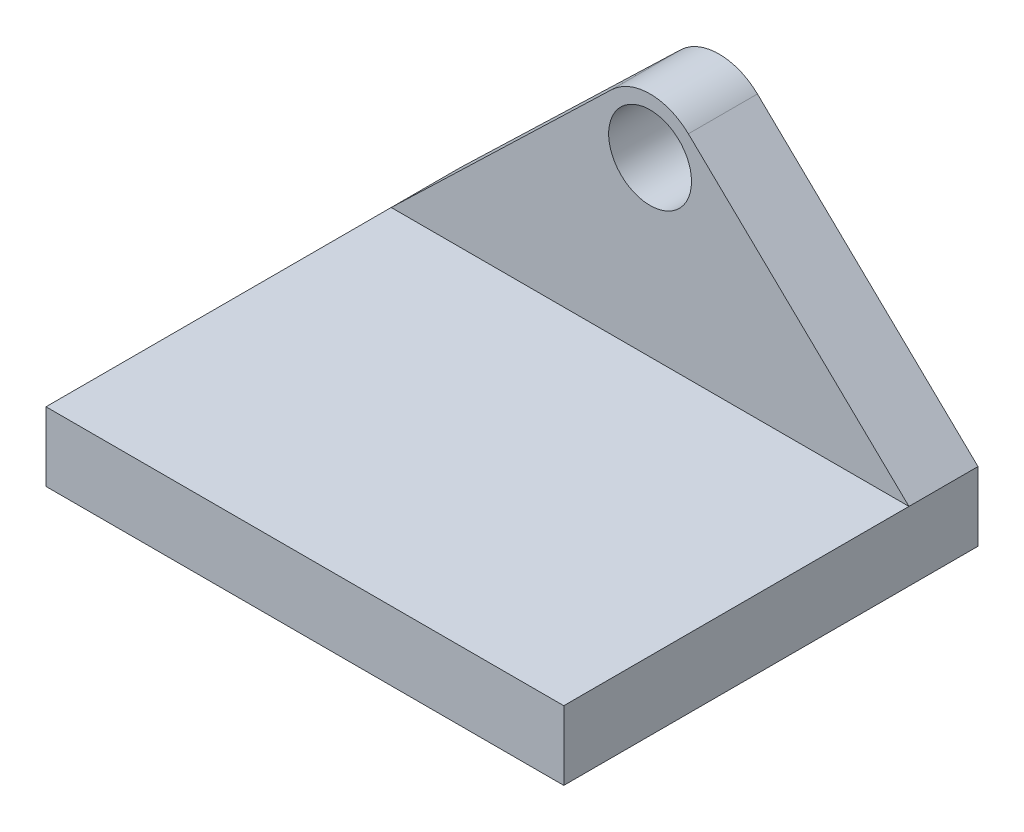
ISO-10303-21;
HEADER;
FILE_DESCRIPTION(('STEP AP214'),'2;1');
FILE_NAME('part.step','',(''),(''),'','','');
FILE_SCHEMA(('AUTOMOTIVE_DESIGN { 1 0 10303 214 1 1 1 1 }'));
ENDSEC;
DATA;
#1=APPLICATION_CONTEXT('core data for automotive mechanical design processes');
#2=APPLICATION_PROTOCOL_DEFINITION('international standard','automotive_design',2000,#1);
#3=PRODUCT_CONTEXT('',#1,'mechanical');
#4=PRODUCT('Part','Part','',(#3));
#5=PRODUCT_RELATED_PRODUCT_CATEGORY('part','',(#4));
#6=PRODUCT_DEFINITION_FORMATION('','',#4);
#7=PRODUCT_DEFINITION_CONTEXT('part definition',#1,'design');
#8=PRODUCT_DEFINITION('design','',#6,#7);
#9=PRODUCT_DEFINITION_SHAPE('','',#8);
#10=(LENGTH_UNIT() NAMED_UNIT(*) SI_UNIT(.MILLI.,.METRE.));
#11=(NAMED_UNIT(*) PLANE_ANGLE_UNIT() SI_UNIT($,.RADIAN.));
#12=(NAMED_UNIT(*) SI_UNIT($,.STERADIAN.) SOLID_ANGLE_UNIT());
#13=UNCERTAINTY_MEASURE_WITH_UNIT(LENGTH_MEASURE(1.E-05),#10,'distance_accuracy_value','');
#14=(GEOMETRIC_REPRESENTATION_CONTEXT(3) GLOBAL_UNCERTAINTY_ASSIGNED_CONTEXT((#13)) GLOBAL_UNIT_ASSIGNED_CONTEXT((#10,
#11,#12)) REPRESENTATION_CONTEXT('',''));
#15=CARTESIAN_POINT('',(0.,0.,0.));
#16=DIRECTION('',(0.,0.,1.));
#17=DIRECTION('',(1.,0.,0.));
#18=AXIS2_PLACEMENT_3D('',#15,#16,#17);
#19=CARTESIAN_POINT('',(0.,30.,0.));
#20=DIRECTION('',(0.,0.,1.));
#21=DIRECTION('',(1.,0.,0.));
#22=AXIS2_PLACEMENT_3D('',#19,#20,#21);
#23=PLANE('',#22);
#24=CARTESIAN_POINT('',(0.,30.,0.));
#25=DIRECTION('',(0.,0.,1.));
#26=DIRECTION('',(1.,0.,0.));
#27=AXIS2_PLACEMENT_3D('',#24,#25,#26);
#28=CIRCLE('',#27,6.);
#29=CARTESIAN_POINT('',(6.,30.,0.));
#30=VERTEX_POINT('',#29);
#31=EDGE_CURVE('E251',#30,#30,#28,.T.);
#32=ORIENTED_EDGE('',*,*,#31,.T.);
#33=EDGE_LOOP('',(#32));
#34=FACE_BOUND('',#33,.T.);
#35=DIRECTION('',(0.,-1.,0.));
#36=VECTOR('',#35,1.);
#37=CARTESIAN_POINT('',(-37.5,-5.,0.));
#38=LINE('',#37,#36);
#39=CARTESIAN_POINT('',(-37.5,5.,0.));
#40=VERTEX_POINT('',#39);
#41=CARTESIAN_POINT('',(-37.5,-5.,0.));
#42=VERTEX_POINT('',#41);
#43=EDGE_CURVE('E273',#40,#42,#38,.T.);
#44=ORIENTED_EDGE('',*,*,#43,.F.);
#45=DIRECTION('',(-0.720375853549973,-0.693583902366648,0.));
#46=VECTOR('',#45,1.);
#47=CARTESIAN_POINT('',(-37.5,5.,0.));
#48=LINE('',#47,#46);
#49=CARTESIAN_POINT('',(-5.54867121893319,35.7630068283998,0.));
#50=VERTEX_POINT('',#49);
#51=EDGE_CURVE('E271',#50,#40,#48,.T.);
#52=ORIENTED_EDGE('',*,*,#51,.F.);
#53=CARTESIAN_POINT('',(0.,30.,0.));
#54=DIRECTION('',(0.,0.,1.));
#55=DIRECTION('',(1.,0.,0.));
#56=AXIS2_PLACEMENT_3D('',#53,#54,#55);
#57=CIRCLE('',#56,8.);
#58=CARTESIAN_POINT('',(5.54867121893319,35.7630068283998,0.));
#59=VERTEX_POINT('',#58);
#60=EDGE_CURVE('E269',#59,#50,#57,.T.);
#61=ORIENTED_EDGE('',*,*,#60,.F.);
#62=DIRECTION('',(-0.720375853549972,0.693583902366649,0.));
#63=VECTOR('',#62,1.);
#64=CARTESIAN_POINT('',(37.5,5.,0.));
#65=LINE('',#64,#63);
#66=CARTESIAN_POINT('',(37.5,5.,0.));
#67=VERTEX_POINT('',#66);
#68=EDGE_CURVE('E255',#67,#59,#65,.T.);
#69=ORIENTED_EDGE('',*,*,#68,.F.);
#70=DIRECTION('',(0.,1.,0.));
#71=VECTOR('',#70,1.);
#72=CARTESIAN_POINT('',(37.5,-5.,0.));
#73=LINE('',#72,#71);
#74=CARTESIAN_POINT('',(37.5,-5.,0.));
#75=VERTEX_POINT('',#74);
#76=EDGE_CURVE('E262',#75,#67,#73,.T.);
#77=ORIENTED_EDGE('',*,*,#76,.F.);
#78=DIRECTION('',(1.,0.,0.));
#79=VECTOR('',#78,1.);
#80=CARTESIAN_POINT('',(-37.5,-5.,0.));
#81=LINE('',#80,#79);
#82=EDGE_CURVE('E275',#42,#75,#81,.T.);
#83=ORIENTED_EDGE('',*,*,#82,.F.);
#84=EDGE_LOOP('',(#44,#52,#61,#69,#77,#83));
#85=FACE_BOUND('',#84,.T.);
#86=DIRECTION('',(-1.,0.,0.));
#87=VECTOR('',#86,1.);
#88=CARTESIAN_POINT('',(0.,0.,0.));
#89=LINE('',#88,#87);
#90=CARTESIAN_POINT('',(-5.,0.,0.));
#91=VERTEX_POINT('',#90);
#92=CARTESIAN_POINT('',(-15.,0.,0.));
#93=VERTEX_POINT('',#92);
#94=EDGE_CURVE('E194',#91,#93,#89,.T.);
#95=ORIENTED_EDGE('',*,*,#94,.F.);
#96=DIRECTION('',(0.,-1.,0.));
#97=VECTOR('',#96,1.);
#98=CARTESIAN_POINT('',(-5.,0.,0.));
#99=LINE('',#98,#97);
#100=CARTESIAN_POINT('',(-5.,10.,0.));
#101=VERTEX_POINT('',#100);
#102=EDGE_CURVE('E56',#101,#91,#99,.T.);
#103=ORIENTED_EDGE('',*,*,#102,.F.);
#104=DIRECTION('',(-1.,0.,0.));
#105=VECTOR('',#104,1.);
#106=CARTESIAN_POINT('',(0.,10.,0.));
#107=LINE('',#106,#105);
#108=CARTESIAN_POINT('',(-15.,10.,0.));
#109=VERTEX_POINT('',#108);
#110=EDGE_CURVE('E184',#101,#109,#107,.T.);
#111=ORIENTED_EDGE('',*,*,#110,.T.);
#112=DIRECTION('',(0.,1.,0.));
#113=VECTOR('',#112,1.);
#114=CARTESIAN_POINT('',(-15.,0.,0.));
#115=LINE('',#114,#113);
#116=EDGE_CURVE('E197',#93,#109,#115,.T.);
#117=ORIENTED_EDGE('',*,*,#116,.F.);
#118=EDGE_LOOP('',(#95,#103,#111,#117));
#119=FACE_BOUND('',#118,.T.);
#120=DIRECTION('',(-1.,0.,0.));
#121=VECTOR('',#120,1.);
#122=CARTESIAN_POINT('',(0.,10.,0.));
#123=LINE('',#122,#121);
#124=CARTESIAN_POINT('',(15.,10.,0.));
#125=VERTEX_POINT('',#124);
#126=CARTESIAN_POINT('',(5.,10.,0.));
#127=VERTEX_POINT('',#126);
#128=EDGE_CURVE('E48',#125,#127,#123,.T.);
#129=ORIENTED_EDGE('',*,*,#128,.T.);
#130=DIRECTION('',(0.,-1.,0.));
#131=VECTOR('',#130,1.);
#132=CARTESIAN_POINT('',(5.,0.,0.));
#133=LINE('',#132,#131);
#134=CARTESIAN_POINT('',(5.,0.,0.));
#135=VERTEX_POINT('',#134);
#136=EDGE_CURVE('E160',#127,#135,#133,.T.);
#137=ORIENTED_EDGE('',*,*,#136,.T.);
#138=DIRECTION('',(-1.,0.,0.));
#139=VECTOR('',#138,1.);
#140=CARTESIAN_POINT('',(0.,0.,0.));
#141=LINE('',#140,#139);
#142=CARTESIAN_POINT('',(15.,0.,0.));
#143=VERTEX_POINT('',#142);
#144=EDGE_CURVE('E163',#143,#135,#141,.T.);
#145=ORIENTED_EDGE('',*,*,#144,.F.);
#146=DIRECTION('',(0.,1.,0.));
#147=VECTOR('',#146,1.);
#148=CARTESIAN_POINT('',(15.,0.,0.));
#149=LINE('',#148,#147);
#150=EDGE_CURVE('E169',#143,#125,#149,.T.);
#151=ORIENTED_EDGE('',*,*,#150,.T.);
#152=EDGE_LOOP('',(#129,#137,#145,#151));
#153=FACE_BOUND('',#152,.T.);
#154=ADVANCED_FACE('F33',(#34,#85,#119,#153),#23,.F.);
#155=CARTESIAN_POINT('',(0.,30.,10.));
#156=DIRECTION('',(0.,0.,1.));
#157=DIRECTION('',(1.,0.,0.));
#158=AXIS2_PLACEMENT_3D('',#155,#156,#157);
#159=PLANE('',#158);
#160=CARTESIAN_POINT('',(0.,30.,10.));
#161=DIRECTION('',(0.,0.,1.));
#162=DIRECTION('',(1.,0.,0.));
#163=AXIS2_PLACEMENT_3D('',#160,#161,#162);
#164=CIRCLE('',#163,6.);
#165=CARTESIAN_POINT('',(6.,30.,10.));
#166=VERTEX_POINT('',#165);
#167=EDGE_CURVE('E252',#166,#166,#164,.T.);
#168=ORIENTED_EDGE('',*,*,#167,.F.);
#169=EDGE_LOOP('',(#168));
#170=FACE_BOUND('',#169,.T.);
#171=DIRECTION('',(-0.720375853549973,-0.693583902366648,0.));
#172=VECTOR('',#171,1.);
#173=CARTESIAN_POINT('',(-37.5,5.,10.));
#174=LINE('',#173,#172);
#175=CARTESIAN_POINT('',(-5.54867121893319,35.7630068283998,10.));
#176=VERTEX_POINT('',#175);
#177=CARTESIAN_POINT('',(-37.5,5.,10.));
#178=VERTEX_POINT('',#177);
#179=EDGE_CURVE('E264',#176,#178,#174,.T.);
#180=ORIENTED_EDGE('',*,*,#179,.T.);
#181=DIRECTION('',(1.,0.,0.));
#182=VECTOR('',#181,1.);
#183=CARTESIAN_POINT('',(0.,5.,10.));
#184=LINE('',#183,#182);
#185=CARTESIAN_POINT('',(37.5,5.,10.));
#186=VERTEX_POINT('',#185);
#187=EDGE_CURVE('E248',#178,#186,#184,.T.);
#188=ORIENTED_EDGE('',*,*,#187,.T.);
#189=DIRECTION('',(-0.720375853549972,0.693583902366649,0.));
#190=VECTOR('',#189,1.);
#191=CARTESIAN_POINT('',(37.5,5.,10.));
#192=LINE('',#191,#190);
#193=CARTESIAN_POINT('',(5.54867121893319,35.7630068283998,10.));
#194=VERTEX_POINT('',#193);
#195=EDGE_CURVE('E258',#186,#194,#192,.T.);
#196=ORIENTED_EDGE('',*,*,#195,.T.);
#197=CARTESIAN_POINT('',(0.,30.,10.));
#198=DIRECTION('',(0.,0.,1.));
#199=DIRECTION('',(1.,0.,0.));
#200=AXIS2_PLACEMENT_3D('',#197,#198,#199);
#201=CIRCLE('',#200,8.);
#202=EDGE_CURVE('E261',#194,#176,#201,.T.);
#203=ORIENTED_EDGE('',*,*,#202,.T.);
#204=EDGE_LOOP('',(#180,#188,#196,#203));
#205=FACE_BOUND('',#204,.T.);
#206=ADVANCED_FACE('F320',(#170,#205),#159,.T.);
#207=CARTESIAN_POINT('',(37.5,5.,10.));
#208=DIRECTION('',(-0.693583902366649,-0.720375853549972,0.));
#209=DIRECTION('',(0.720375853549972,-0.693583902366649,0.));
#210=AXIS2_PLACEMENT_3D('',#207,#208,#209);
#211=PLANE('',#210);
#212=ORIENTED_EDGE('',*,*,#68,.T.);
#213=DIRECTION('',(0.,0.,-1.));
#214=VECTOR('',#213,1.);
#215=CARTESIAN_POINT('',(5.54867121893319,35.7630068283998,10.));
#216=LINE('',#215,#214);
#217=EDGE_CURVE('E11',#194,#59,#216,.T.);
#218=ORIENTED_EDGE('',*,*,#217,.F.);
#219=ORIENTED_EDGE('',*,*,#195,.F.);
#220=DIRECTION('',(0.,0.,-1.));
#221=VECTOR('',#220,1.);
#222=CARTESIAN_POINT('',(37.5,5.,10.));
#223=LINE('',#222,#221);
#224=EDGE_CURVE('E266',#186,#67,#223,.T.);
#225=ORIENTED_EDGE('',*,*,#224,.T.);
#226=EDGE_LOOP('',(#212,#218,#219,#225));
#227=FACE_BOUND('',#226,.T.);
#228=ADVANCED_FACE('F35',(#227),#211,.F.);
#229=CARTESIAN_POINT('',(0.,30.,10.));
#230=DIRECTION('',(0.,0.,-1.));
#231=DIRECTION('',(-1.,0.,0.));
#232=AXIS2_PLACEMENT_3D('',#229,#230,#231);
#233=CYLINDRICAL_SURFACE('',#232,8.);
#234=ORIENTED_EDGE('',*,*,#60,.T.);
#235=DIRECTION('',(0.,0.,-1.));
#236=VECTOR('',#235,1.);
#237=CARTESIAN_POINT('',(-5.54867121893319,35.7630068283998,10.));
#238=LINE('',#237,#236);
#239=EDGE_CURVE('E41',#176,#50,#238,.T.);
#240=ORIENTED_EDGE('',*,*,#239,.F.);
#241=ORIENTED_EDGE('',*,*,#202,.F.);
#242=ORIENTED_EDGE('',*,*,#217,.T.);
#243=EDGE_LOOP('',(#234,#240,#241,#242));
#244=FACE_BOUND('',#243,.T.);
#245=ADVANCED_FACE('F322',(#244),#233,.T.);
#246=CARTESIAN_POINT('',(-37.5,5.,10.));
#247=DIRECTION('',(0.693583902366648,-0.720375853549973,0.));
#248=DIRECTION('',(0.720375853549973,0.693583902366648,0.));
#249=AXIS2_PLACEMENT_3D('',#246,#247,#248);
#250=PLANE('',#249);
#251=ORIENTED_EDGE('',*,*,#51,.T.);
#252=DIRECTION('',(0.,0.,-1.));
#253=VECTOR('',#252,1.);
#254=CARTESIAN_POINT('',(-37.5,5.,10.));
#255=LINE('',#254,#253);
#256=EDGE_CURVE('E286',#178,#40,#255,.T.);
#257=ORIENTED_EDGE('',*,*,#256,.F.);
#258=ORIENTED_EDGE('',*,*,#179,.F.);
#259=ORIENTED_EDGE('',*,*,#239,.T.);
#260=EDGE_LOOP('',(#251,#257,#258,#259));
#261=FACE_BOUND('',#260,.T.);
#262=ADVANCED_FACE('F293',(#261),#250,.F.);
#263=CARTESIAN_POINT('',(-37.5,-5.,10.));
#264=DIRECTION('',(1.,0.,0.));
#265=DIRECTION('',(0.,0.,-1.));
#266=AXIS2_PLACEMENT_3D('',#263,#264,#265);
#267=PLANE('',#266);
#268=ORIENTED_EDGE('',*,*,#43,.T.);
#269=DIRECTION('',(0.,0.,-1.));
#270=VECTOR('',#269,1.);
#271=CARTESIAN_POINT('',(-37.5,-5.,10.));
#272=LINE('',#271,#270);
#273=CARTESIAN_POINT('',(-37.5,-5.,60.));
#274=VERTEX_POINT('',#273);
#275=EDGE_CURVE('E283',#274,#42,#272,.T.);
#276=ORIENTED_EDGE('',*,*,#275,.F.);
#277=DIRECTION('',(0.,-1.,0.));
#278=VECTOR('',#277,1.);
#279=CARTESIAN_POINT('',(-37.5,5.,60.));
#280=LINE('',#279,#278);
#281=CARTESIAN_POINT('',(-37.5,5.,60.));
#282=VERTEX_POINT('',#281);
#283=EDGE_CURVE('E234',#282,#274,#280,.T.);
#284=ORIENTED_EDGE('',*,*,#283,.F.);
#285=DIRECTION('',(0.,0.,-1.));
#286=VECTOR('',#285,1.);
#287=CARTESIAN_POINT('',(-37.5,5.,60.));
#288=LINE('',#287,#286);
#289=EDGE_CURVE('E245',#282,#178,#288,.T.);
#290=ORIENTED_EDGE('',*,*,#289,.T.);
#291=ORIENTED_EDGE('',*,*,#256,.T.);
#292=EDGE_LOOP('',(#268,#276,#284,#290,#291));
#293=FACE_BOUND('',#292,.T.);
#294=ADVANCED_FACE('F303',(#293),#267,.F.);
#295=CARTESIAN_POINT('',(-37.5,-5.,10.));
#296=DIRECTION('',(0.,1.,0.));
#297=DIRECTION('',(0.,0.,1.));
#298=AXIS2_PLACEMENT_3D('',#295,#296,#297);
#299=PLANE('',#298);
#300=CARTESIAN_POINT('',(27.5,-5.,5.));
#301=DIRECTION('',(0.,-1.,0.));
#302=DIRECTION('',(0.,0.,-1.));
#303=AXIS2_PLACEMENT_3D('',#300,#301,#302);
#304=CIRCLE('',#303,2.25);
#305=CARTESIAN_POINT('',(27.5,-5.,2.75));
#306=VERTEX_POINT('',#305);
#307=EDGE_CURVE('E212',#306,#306,#304,.T.);
#308=ORIENTED_EDGE('',*,*,#307,.F.);
#309=EDGE_LOOP('',(#308));
#310=FACE_BOUND('',#309,.T.);
#311=CARTESIAN_POINT('',(12.5,-5.,5.));
#312=DIRECTION('',(0.,-1.,0.));
#313=DIRECTION('',(0.,0.,-1.));
#314=AXIS2_PLACEMENT_3D('',#311,#312,#313);
#315=CIRCLE('',#314,2.25);
#316=CARTESIAN_POINT('',(12.5,-5.,2.75));
#317=VERTEX_POINT('',#316);
#318=EDGE_CURVE('E218',#317,#317,#315,.T.);
#319=ORIENTED_EDGE('',*,*,#318,.F.);
#320=EDGE_LOOP('',(#319));
#321=FACE_BOUND('',#320,.T.);
#322=CARTESIAN_POINT('',(-12.5,-5.,5.));
#323=DIRECTION('',(0.,-1.,0.));
#324=DIRECTION('',(0.,0.,-1.));
#325=AXIS2_PLACEMENT_3D('',#322,#323,#324);
#326=CIRCLE('',#325,2.25);
#327=CARTESIAN_POINT('',(-12.5,-5.,2.75));
#328=VERTEX_POINT('',#327);
#329=EDGE_CURVE('E224',#328,#328,#326,.T.);
#330=ORIENTED_EDGE('',*,*,#329,.F.);
#331=EDGE_LOOP('',(#330));
#332=FACE_BOUND('',#331,.T.);
#333=CARTESIAN_POINT('',(-27.5,-5.,5.));
#334=DIRECTION('',(0.,-1.,0.));
#335=DIRECTION('',(0.,0.,-1.));
#336=AXIS2_PLACEMENT_3D('',#333,#334,#335);
#337=CIRCLE('',#336,2.25);
#338=CARTESIAN_POINT('',(-27.5,-5.,2.75));
#339=VERTEX_POINT('',#338);
#340=EDGE_CURVE('E176',#339,#339,#337,.T.);
#341=ORIENTED_EDGE('',*,*,#340,.F.);
#342=EDGE_LOOP('',(#341));
#343=FACE_BOUND('',#342,.T.);
#344=ORIENTED_EDGE('',*,*,#82,.T.);
#345=DIRECTION('',(0.,0.,-1.));
#346=VECTOR('',#345,1.);
#347=CARTESIAN_POINT('',(37.5,-5.,10.));
#348=LINE('',#347,#346);
#349=CARTESIAN_POINT('',(37.5,-5.,60.));
#350=VERTEX_POINT('',#349);
#351=EDGE_CURVE('E280',#350,#75,#348,.T.);
#352=ORIENTED_EDGE('',*,*,#351,.F.);
#353=DIRECTION('',(1.,0.,0.));
#354=VECTOR('',#353,1.);
#355=CARTESIAN_POINT('',(-37.5,-5.,60.));
#356=LINE('',#355,#354);
#357=EDGE_CURVE('E237',#274,#350,#356,.T.);
#358=ORIENTED_EDGE('',*,*,#357,.F.);
#359=ORIENTED_EDGE('',*,*,#275,.T.);
#360=EDGE_LOOP('',(#344,#352,#358,#359));
#361=FACE_BOUND('',#360,.T.);
#362=ADVANCED_FACE('F306',(#310,#321,#332,#343,#361),#299,.F.);
#363=CARTESIAN_POINT('',(37.5,-5.,10.));
#364=DIRECTION('',(-1.,0.,0.));
#365=DIRECTION('',(0.,0.,1.));
#366=AXIS2_PLACEMENT_3D('',#363,#364,#365);
#367=PLANE('',#366);
#368=ORIENTED_EDGE('',*,*,#76,.T.);
#369=ORIENTED_EDGE('',*,*,#224,.F.);
#370=DIRECTION('',(0.,0.,-1.));
#371=VECTOR('',#370,1.);
#372=CARTESIAN_POINT('',(37.5,5.,60.));
#373=LINE('',#372,#371);
#374=CARTESIAN_POINT('',(37.5,5.,60.));
#375=VERTEX_POINT('',#374);
#376=EDGE_CURVE('E242',#375,#186,#373,.T.);
#377=ORIENTED_EDGE('',*,*,#376,.F.);
#378=DIRECTION('',(0.,1.,0.));
#379=VECTOR('',#378,1.);
#380=CARTESIAN_POINT('',(37.5,-5.,60.));
#381=LINE('',#380,#379);
#382=EDGE_CURVE('E240',#350,#375,#381,.T.);
#383=ORIENTED_EDGE('',*,*,#382,.F.);
#384=ORIENTED_EDGE('',*,*,#351,.T.);
#385=EDGE_LOOP('',(#368,#369,#377,#383,#384));
#386=FACE_BOUND('',#385,.T.);
#387=ADVANCED_FACE('F312',(#386),#367,.F.);
#388=CARTESIAN_POINT('',(0.,30.,10.));
#389=DIRECTION('',(0.,0.,-1.));
#390=DIRECTION('',(-1.,0.,0.));
#391=AXIS2_PLACEMENT_3D('',#388,#389,#390);
#392=CYLINDRICAL_SURFACE('',#391,6.);
#393=ORIENTED_EDGE('',*,*,#167,.T.);
#394=EDGE_LOOP('',(#393));
#395=FACE_BOUND('',#394,.T.);
#396=ORIENTED_EDGE('',*,*,#31,.F.);
#397=EDGE_LOOP('',(#396));
#398=FACE_BOUND('',#397,.T.);
#399=ADVANCED_FACE('F342',(#395,#398),#392,.F.);
#400=CARTESIAN_POINT('',(-37.5,5.,60.));
#401=DIRECTION('',(0.,-1.,0.));
#402=DIRECTION('',(0.,0.,-1.));
#403=AXIS2_PLACEMENT_3D('',#400,#401,#402);
#404=PLANE('',#403);
#405=ORIENTED_EDGE('',*,*,#187,.F.);
#406=ORIENTED_EDGE('',*,*,#289,.F.);
#407=DIRECTION('',(-1.,0.,0.));
#408=VECTOR('',#407,1.);
#409=CARTESIAN_POINT('',(-37.5,5.,60.));
#410=LINE('',#409,#408);
#411=EDGE_CURVE('E211',#375,#282,#410,.T.);
#412=ORIENTED_EDGE('',*,*,#411,.F.);
#413=ORIENTED_EDGE('',*,*,#376,.T.);
#414=EDGE_LOOP('',(#405,#406,#412,#413));
#415=FACE_BOUND('',#414,.T.);
#416=ADVANCED_FACE('F318',(#415),#404,.F.);
#417=CARTESIAN_POINT('',(0.,0.,60.));
#418=DIRECTION('',(0.,0.,1.));
#419=DIRECTION('',(1.,0.,0.));
#420=AXIS2_PLACEMENT_3D('',#417,#418,#419);
#421=PLANE('',#420);
#422=ORIENTED_EDGE('',*,*,#411,.T.);
#423=ORIENTED_EDGE('',*,*,#283,.T.);
#424=ORIENTED_EDGE('',*,*,#357,.T.);
#425=ORIENTED_EDGE('',*,*,#382,.T.);
#426=EDGE_LOOP('',(#422,#423,#424,#425));
#427=FACE_BOUND('',#426,.T.);
#428=ADVANCED_FACE('F309',(#427),#421,.T.);
#429=CARTESIAN_POINT('',(-27.5,4.,5.));
#430=DIRECTION('',(0.,-1.,0.));
#431=DIRECTION('',(0.,0.,-1.));
#432=AXIS2_PLACEMENT_3D('',#429,#430,#431);
#433=CYLINDRICAL_SURFACE('',#432,2.25);
#434=CARTESIAN_POINT('',(-27.5,4.,5.));
#435=DIRECTION('',(0.,-1.,0.));
#436=DIRECTION('',(0.,0.,-1.));
#437=AXIS2_PLACEMENT_3D('',#434,#435,#436);
#438=CIRCLE('',#437,2.25);
#439=CARTESIAN_POINT('',(-27.5,4.,2.75));
#440=VERTEX_POINT('',#439);
#441=EDGE_CURVE('E227',#440,#440,#438,.T.);
#442=ORIENTED_EDGE('',*,*,#441,.F.);
#443=EDGE_LOOP('',(#442));
#444=FACE_BOUND('',#443,.T.);
#445=ORIENTED_EDGE('',*,*,#340,.T.);
#446=EDGE_LOOP('',(#445));
#447=FACE_BOUND('',#446,.T.);
#448=ADVANCED_FACE('F385',(#444,#447),#433,.F.);
#449=CARTESIAN_POINT('',(0.,4.,0.));
#450=DIRECTION('',(0.,-1.,0.));
#451=DIRECTION('',(0.,0.,-1.));
#452=AXIS2_PLACEMENT_3D('',#449,#450,#451);
#453=PLANE('',#452);
#454=ORIENTED_EDGE('',*,*,#441,.T.);
#455=EDGE_LOOP('',(#454));
#456=FACE_BOUND('',#455,.T.);
#457=ADVANCED_FACE('F391',(#456),#453,.T.);
#458=CARTESIAN_POINT('',(-12.5,4.,5.));
#459=DIRECTION('',(0.,-1.,0.));
#460=DIRECTION('',(0.,0.,-1.));
#461=AXIS2_PLACEMENT_3D('',#458,#459,#460);
#462=CYLINDRICAL_SURFACE('',#461,2.25);
#463=CARTESIAN_POINT('',(-12.5,4.,5.));
#464=DIRECTION('',(0.,-1.,0.));
#465=DIRECTION('',(0.,0.,-1.));
#466=AXIS2_PLACEMENT_3D('',#463,#464,#465);
#467=CIRCLE('',#466,2.25);
#468=CARTESIAN_POINT('',(-12.5,4.,2.75));
#469=VERTEX_POINT('',#468);
#470=EDGE_CURVE('E221',#469,#469,#467,.T.);
#471=ORIENTED_EDGE('',*,*,#470,.F.);
#472=EDGE_LOOP('',(#471));
#473=FACE_BOUND('',#472,.T.);
#474=ORIENTED_EDGE('',*,*,#329,.T.);
#475=EDGE_LOOP('',(#474));
#476=FACE_BOUND('',#475,.T.);
#477=ADVANCED_FACE('F399',(#473,#476),#462,.F.);
#478=CARTESIAN_POINT('',(0.,4.,0.));
#479=DIRECTION('',(0.,-1.,0.));
#480=DIRECTION('',(0.,0.,-1.));
#481=AXIS2_PLACEMENT_3D('',#478,#479,#480);
#482=PLANE('',#481);
#483=ORIENTED_EDGE('',*,*,#470,.T.);
#484=EDGE_LOOP('',(#483));
#485=FACE_BOUND('',#484,.T.);
#486=ADVANCED_FACE('F407',(#485),#482,.T.);
#487=CARTESIAN_POINT('',(12.5,4.,5.));
#488=DIRECTION('',(0.,-1.,0.));
#489=DIRECTION('',(0.,0.,-1.));
#490=AXIS2_PLACEMENT_3D('',#487,#488,#489);
#491=CYLINDRICAL_SURFACE('',#490,2.25);
#492=CARTESIAN_POINT('',(12.5,4.,5.));
#493=DIRECTION('',(0.,-1.,0.));
#494=DIRECTION('',(0.,0.,-1.));
#495=AXIS2_PLACEMENT_3D('',#492,#493,#494);
#496=CIRCLE('',#495,2.25);
#497=CARTESIAN_POINT('',(12.5,4.,2.75));
#498=VERTEX_POINT('',#497);
#499=EDGE_CURVE('E215',#498,#498,#496,.T.);
#500=ORIENTED_EDGE('',*,*,#499,.F.);
#501=EDGE_LOOP('',(#500));
#502=FACE_BOUND('',#501,.T.);
#503=ORIENTED_EDGE('',*,*,#318,.T.);
#504=EDGE_LOOP('',(#503));
#505=FACE_BOUND('',#504,.T.);
#506=ADVANCED_FACE('F415',(#502,#505),#491,.F.);
#507=CARTESIAN_POINT('',(0.,4.,0.));
#508=DIRECTION('',(0.,-1.,0.));
#509=DIRECTION('',(0.,0.,-1.));
#510=AXIS2_PLACEMENT_3D('',#507,#508,#509);
#511=PLANE('',#510);
#512=ORIENTED_EDGE('',*,*,#499,.T.);
#513=EDGE_LOOP('',(#512));
#514=FACE_BOUND('',#513,.T.);
#515=ADVANCED_FACE('F423',(#514),#511,.T.);
#516=CARTESIAN_POINT('',(27.5,4.,5.));
#517=DIRECTION('',(0.,-1.,0.));
#518=DIRECTION('',(0.,0.,-1.));
#519=AXIS2_PLACEMENT_3D('',#516,#517,#518);
#520=CYLINDRICAL_SURFACE('',#519,2.25);
#521=CARTESIAN_POINT('',(27.5,4.,5.));
#522=DIRECTION('',(0.,-1.,0.));
#523=DIRECTION('',(0.,0.,-1.));
#524=AXIS2_PLACEMENT_3D('',#521,#522,#523);
#525=CIRCLE('',#524,2.25);
#526=CARTESIAN_POINT('',(27.5,4.,2.75));
#527=VERTEX_POINT('',#526);
#528=EDGE_CURVE('E208',#527,#527,#525,.T.);
#529=ORIENTED_EDGE('',*,*,#528,.F.);
#530=EDGE_LOOP('',(#529));
#531=FACE_BOUND('',#530,.T.);
#532=ORIENTED_EDGE('',*,*,#307,.T.);
#533=EDGE_LOOP('',(#532));
#534=FACE_BOUND('',#533,.T.);
#535=ADVANCED_FACE('F431',(#531,#534),#520,.F.);
#536=CARTESIAN_POINT('',(0.,4.,0.));
#537=DIRECTION('',(0.,-1.,0.));
#538=DIRECTION('',(0.,0.,-1.));
#539=AXIS2_PLACEMENT_3D('',#536,#537,#538);
#540=PLANE('',#539);
#541=ORIENTED_EDGE('',*,*,#528,.T.);
#542=EDGE_LOOP('',(#541));
#543=FACE_BOUND('',#542,.T.);
#544=ADVANCED_FACE('F439',(#543),#540,.T.);
#545=CARTESIAN_POINT('',(-5.,0.,2.5));
#546=DIRECTION('',(1.,0.,0.));
#547=DIRECTION('',(0.,1.,0.));
#548=AXIS2_PLACEMENT_3D('',#545,#546,#547);
#549=PLANE('',#548);
#550=ORIENTED_EDGE('',*,*,#102,.T.);
#551=DIRECTION('',(0.,0.,-1.));
#552=VECTOR('',#551,1.);
#553=CARTESIAN_POINT('',(-5.,0.,2.5));
#554=LINE('',#553,#552);
#555=CARTESIAN_POINT('',(-5.,0.,2.5));
#556=VERTEX_POINT('',#555);
#557=EDGE_CURVE('E192',#556,#91,#554,.T.);
#558=ORIENTED_EDGE('',*,*,#557,.F.);
#559=DIRECTION('',(0.,-1.,0.));
#560=VECTOR('',#559,1.);
#561=CARTESIAN_POINT('',(-5.,0.,2.5));
#562=LINE('',#561,#560);
#563=CARTESIAN_POINT('',(-5.,10.,2.5));
#564=VERTEX_POINT('',#563);
#565=EDGE_CURVE('E180',#564,#556,#562,.T.);
#566=ORIENTED_EDGE('',*,*,#565,.F.);
#567=DIRECTION('',(0.,0.,-1.));
#568=VECTOR('',#567,1.);
#569=CARTESIAN_POINT('',(-5.,10.,2.5));
#570=LINE('',#569,#568);
#571=EDGE_CURVE('E170',#564,#101,#570,.T.);
#572=ORIENTED_EDGE('',*,*,#571,.T.);
#573=EDGE_LOOP('',(#550,#558,#566,#572));
#574=FACE_BOUND('',#573,.T.);
#575=ADVANCED_FACE('F446',(#574),#549,.F.);
#576=CARTESIAN_POINT('',(0.,10.,2.5));
#577=DIRECTION('',(0.,-1.,0.));
#578=DIRECTION('',(0.,0.,-1.));
#579=AXIS2_PLACEMENT_3D('',#576,#577,#578);
#580=PLANE('',#579);
#581=ORIENTED_EDGE('',*,*,#110,.F.);
#582=ORIENTED_EDGE('',*,*,#571,.F.);
#583=DIRECTION('',(-1.,0.,0.));
#584=VECTOR('',#583,1.);
#585=CARTESIAN_POINT('',(0.,10.,2.5));
#586=LINE('',#585,#584);
#587=CARTESIAN_POINT('',(-15.,10.,2.5));
#588=VERTEX_POINT('',#587);
#589=EDGE_CURVE('E190',#564,#588,#586,.T.);
#590=ORIENTED_EDGE('',*,*,#589,.T.);
#591=DIRECTION('',(0.,0.,-1.));
#592=VECTOR('',#591,1.);
#593=CARTESIAN_POINT('',(-15.,10.,2.5));
#594=LINE('',#593,#592);
#595=EDGE_CURVE('E203',#588,#109,#594,.T.);
#596=ORIENTED_EDGE('',*,*,#595,.T.);
#597=EDGE_LOOP('',(#581,#582,#590,#596));
#598=FACE_BOUND('',#597,.T.);
#599=ADVANCED_FACE('F458',(#598),#580,.T.);
#600=CARTESIAN_POINT('',(-15.,0.,2.5));
#601=DIRECTION('',(-1.,0.,0.));
#602=DIRECTION('',(0.,0.,1.));
#603=AXIS2_PLACEMENT_3D('',#600,#601,#602);
#604=PLANE('',#603);
#605=ORIENTED_EDGE('',*,*,#116,.T.);
#606=ORIENTED_EDGE('',*,*,#595,.F.);
#607=DIRECTION('',(0.,1.,0.));
#608=VECTOR('',#607,1.);
#609=CARTESIAN_POINT('',(-15.,0.,2.5));
#610=LINE('',#609,#608);
#611=CARTESIAN_POINT('',(-15.,0.,2.5));
#612=VERTEX_POINT('',#611);
#613=EDGE_CURVE('E187',#612,#588,#610,.T.);
#614=ORIENTED_EDGE('',*,*,#613,.F.);
#615=DIRECTION('',(0.,0.,-1.));
#616=VECTOR('',#615,1.);
#617=CARTESIAN_POINT('',(-15.,0.,2.5));
#618=LINE('',#617,#616);
#619=EDGE_CURVE('E205',#612,#93,#618,.T.);
#620=ORIENTED_EDGE('',*,*,#619,.T.);
#621=EDGE_LOOP('',(#605,#606,#614,#620));
#622=FACE_BOUND('',#621,.T.);
#623=ADVANCED_FACE('F464',(#622),#604,.F.);
#624=CARTESIAN_POINT('',(0.,0.,2.5));
#625=DIRECTION('',(0.,-1.,0.));
#626=DIRECTION('',(0.,0.,-1.));
#627=AXIS2_PLACEMENT_3D('',#624,#625,#626);
#628=PLANE('',#627);
#629=ORIENTED_EDGE('',*,*,#94,.T.);
#630=ORIENTED_EDGE('',*,*,#619,.F.);
#631=DIRECTION('',(-1.,0.,0.));
#632=VECTOR('',#631,1.);
#633=CARTESIAN_POINT('',(0.,0.,2.5));
#634=LINE('',#633,#632);
#635=EDGE_CURVE('E183',#556,#612,#634,.T.);
#636=ORIENTED_EDGE('',*,*,#635,.F.);
#637=ORIENTED_EDGE('',*,*,#557,.T.);
#638=EDGE_LOOP('',(#629,#630,#636,#637));
#639=FACE_BOUND('',#638,.T.);
#640=ADVANCED_FACE('F472',(#639),#628,.F.);
#641=CARTESIAN_POINT('',(0.,0.,2.5));
#642=DIRECTION('',(0.,0.,-1.));
#643=DIRECTION('',(-1.,0.,0.));
#644=AXIS2_PLACEMENT_3D('',#641,#642,#643);
#645=PLANE('',#644);
#646=ORIENTED_EDGE('',*,*,#565,.T.);
#647=ORIENTED_EDGE('',*,*,#635,.T.);
#648=ORIENTED_EDGE('',*,*,#613,.T.);
#649=ORIENTED_EDGE('',*,*,#589,.F.);
#650=EDGE_LOOP('',(#646,#647,#648,#649));
#651=FACE_BOUND('',#650,.T.);
#652=ADVANCED_FACE('F480',(#651),#645,.T.);
#653=CARTESIAN_POINT('',(0.,10.,2.5));
#654=DIRECTION('',(0.,-1.,0.));
#655=DIRECTION('',(0.,0.,-1.));
#656=AXIS2_PLACEMENT_3D('',#653,#654,#655);
#657=PLANE('',#656);
#658=ORIENTED_EDGE('',*,*,#128,.F.);
#659=DIRECTION('',(0.,0.,-1.));
#660=VECTOR('',#659,1.);
#661=CARTESIAN_POINT('',(15.,10.,2.5));
#662=LINE('',#661,#660);
#663=CARTESIAN_POINT('',(15.,10.,2.5));
#664=VERTEX_POINT('',#663);
#665=EDGE_CURVE('E144',#664,#125,#662,.T.);
#666=ORIENTED_EDGE('',*,*,#665,.F.);
#667=DIRECTION('',(-1.,0.,0.));
#668=VECTOR('',#667,1.);
#669=CARTESIAN_POINT('',(0.,10.,2.5));
#670=LINE('',#669,#668);
#671=CARTESIAN_POINT('',(5.,10.,2.5));
#672=VERTEX_POINT('',#671);
#673=EDGE_CURVE('E152',#664,#672,#670,.T.);
#674=ORIENTED_EDGE('',*,*,#673,.T.);
#675=DIRECTION('',(0.,0.,-1.));
#676=VECTOR('',#675,1.);
#677=CARTESIAN_POINT('',(5.,10.,2.5));
#678=LINE('',#677,#676);
#679=EDGE_CURVE('E174',#672,#127,#678,.T.);
#680=ORIENTED_EDGE('',*,*,#679,.T.);
#681=EDGE_LOOP('',(#658,#666,#674,#680));
#682=FACE_BOUND('',#681,.T.);
#683=ADVANCED_FACE('F155',(#682),#657,.T.);
#684=CARTESIAN_POINT('',(5.,0.,2.5));
#685=DIRECTION('',(1.,0.,0.));
#686=DIRECTION('',(0.,1.,0.));
#687=AXIS2_PLACEMENT_3D('',#684,#685,#686);
#688=PLANE('',#687);
#689=ORIENTED_EDGE('',*,*,#136,.F.);
#690=ORIENTED_EDGE('',*,*,#679,.F.);
#691=DIRECTION('',(0.,-1.,0.));
#692=VECTOR('',#691,1.);
#693=CARTESIAN_POINT('',(5.,0.,2.5));
#694=LINE('',#693,#692);
#695=CARTESIAN_POINT('',(5.,0.,2.5));
#696=VERTEX_POINT('',#695);
#697=EDGE_CURVE('E157',#672,#696,#694,.T.);
#698=ORIENTED_EDGE('',*,*,#697,.T.);
#699=DIRECTION('',(0.,0.,-1.));
#700=VECTOR('',#699,1.);
#701=CARTESIAN_POINT('',(5.,0.,2.5));
#702=LINE('',#701,#700);
#703=EDGE_CURVE('E177',#696,#135,#702,.T.);
#704=ORIENTED_EDGE('',*,*,#703,.T.);
#705=EDGE_LOOP('',(#689,#690,#698,#704));
#706=FACE_BOUND('',#705,.T.);
#707=ADVANCED_FACE('F495',(#706),#688,.T.);
#708=CARTESIAN_POINT('',(0.,0.,2.5));
#709=DIRECTION('',(0.,-1.,0.));
#710=DIRECTION('',(0.,0.,-1.));
#711=AXIS2_PLACEMENT_3D('',#708,#709,#710);
#712=PLANE('',#711);
#713=ORIENTED_EDGE('',*,*,#144,.T.);
#714=ORIENTED_EDGE('',*,*,#703,.F.);
#715=DIRECTION('',(-1.,0.,0.));
#716=VECTOR('',#715,1.);
#717=CARTESIAN_POINT('',(0.,0.,2.5));
#718=LINE('',#717,#716);
#719=CARTESIAN_POINT('',(15.,0.,2.5));
#720=VERTEX_POINT('',#719);
#721=EDGE_CURVE('E151',#720,#696,#718,.T.);
#722=ORIENTED_EDGE('',*,*,#721,.F.);
#723=DIRECTION('',(0.,0.,-1.));
#724=VECTOR('',#723,1.);
#725=CARTESIAN_POINT('',(15.,0.,2.5));
#726=LINE('',#725,#724);
#727=EDGE_CURVE('E146',#720,#143,#726,.T.);
#728=ORIENTED_EDGE('',*,*,#727,.T.);
#729=EDGE_LOOP('',(#713,#714,#722,#728));
#730=FACE_BOUND('',#729,.T.);
#731=ADVANCED_FACE('F502',(#730),#712,.F.);
#732=CARTESIAN_POINT('',(15.,0.,2.5));
#733=DIRECTION('',(-1.,0.,0.));
#734=DIRECTION('',(0.,0.,1.));
#735=AXIS2_PLACEMENT_3D('',#732,#733,#734);
#736=PLANE('',#735);
#737=ORIENTED_EDGE('',*,*,#150,.F.);
#738=ORIENTED_EDGE('',*,*,#727,.F.);
#739=DIRECTION('',(0.,1.,0.));
#740=VECTOR('',#739,1.);
#741=CARTESIAN_POINT('',(15.,0.,2.5));
#742=LINE('',#741,#740);
#743=EDGE_CURVE('E141',#720,#664,#742,.T.);
#744=ORIENTED_EDGE('',*,*,#743,.T.);
#745=ORIENTED_EDGE('',*,*,#665,.T.);
#746=EDGE_LOOP('',(#737,#738,#744,#745));
#747=FACE_BOUND('',#746,.T.);
#748=ADVANCED_FACE('F143',(#747),#736,.T.);
#749=CARTESIAN_POINT('',(0.,0.,2.5));
#750=DIRECTION('',(0.,0.,-1.));
#751=DIRECTION('',(-1.,0.,0.));
#752=AXIS2_PLACEMENT_3D('',#749,#750,#751);
#753=PLANE('',#752);
#754=ORIENTED_EDGE('',*,*,#673,.F.);
#755=ORIENTED_EDGE('',*,*,#743,.F.);
#756=ORIENTED_EDGE('',*,*,#721,.T.);
#757=ORIENTED_EDGE('',*,*,#697,.F.);
#758=EDGE_LOOP('',(#754,#755,#756,#757));
#759=FACE_BOUND('',#758,.T.);
#760=ADVANCED_FACE('F159',(#759),#753,.T.);
#761=CLOSED_SHELL('',(#154,#206,#228,#245,#262,#294,#362,#387,#399,#416,#428,#448,#457,#477,
#486,#506,#515,#535,#544,#575,#599,#623,#640,#652,#683,#707,#731,#748,#760));
#762=MANIFOLD_SOLID_BREP('B2',#761);
#763=ADVANCED_BREP_SHAPE_REPRESENTATION('',(#18,#762),#14);
#764=SHAPE_DEFINITION_REPRESENTATION(#9,#763);
ENDSEC;
END-ISO-10303-21;
